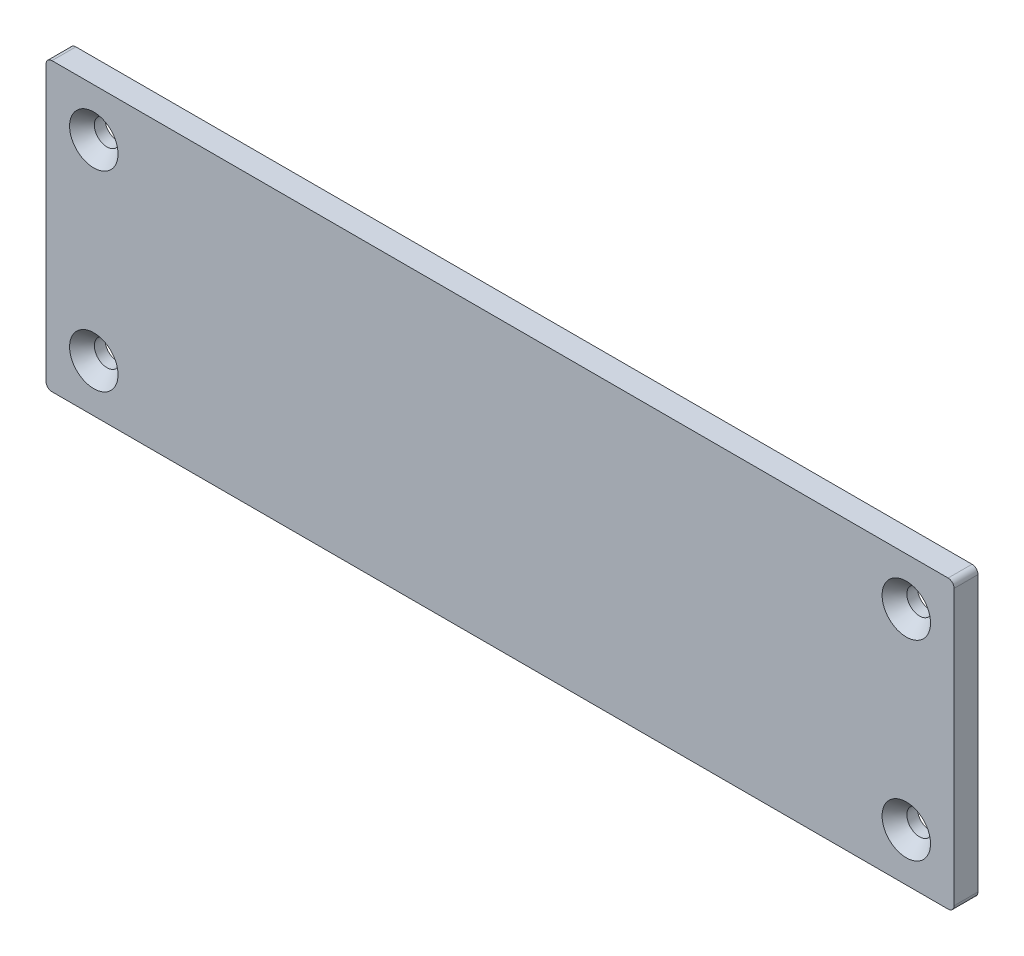
ISO-10303-21;
HEADER;
FILE_DESCRIPTION(('STEP AP214'),'2;1');
FILE_NAME('part.step','',(''),(''),'','','');
FILE_SCHEMA(('AUTOMOTIVE_DESIGN { 1 0 10303 214 1 1 1 1 }'));
ENDSEC;
DATA;
#1=APPLICATION_CONTEXT('core data for automotive mechanical design processes');
#2=APPLICATION_PROTOCOL_DEFINITION('international standard','automotive_design',2000,#1);
#3=PRODUCT_CONTEXT('',#1,'mechanical');
#4=PRODUCT('Part','Part','',(#3));
#5=PRODUCT_RELATED_PRODUCT_CATEGORY('part','',(#4));
#6=PRODUCT_DEFINITION_FORMATION('','',#4);
#7=PRODUCT_DEFINITION_CONTEXT('part definition',#1,'design');
#8=PRODUCT_DEFINITION('design','',#6,#7);
#9=PRODUCT_DEFINITION_SHAPE('','',#8);
#10=(LENGTH_UNIT() NAMED_UNIT(*) SI_UNIT(.MILLI.,.METRE.));
#11=(NAMED_UNIT(*) PLANE_ANGLE_UNIT() SI_UNIT($,.RADIAN.));
#12=(NAMED_UNIT(*) SI_UNIT($,.STERADIAN.) SOLID_ANGLE_UNIT());
#13=UNCERTAINTY_MEASURE_WITH_UNIT(LENGTH_MEASURE(1.E-05),#10,'distance_accuracy_value','');
#14=(GEOMETRIC_REPRESENTATION_CONTEXT(3) GLOBAL_UNCERTAINTY_ASSIGNED_CONTEXT((#13)) GLOBAL_UNIT_ASSIGNED_CONTEXT((#10,
#11,#12)) REPRESENTATION_CONTEXT('',''));
#15=CARTESIAN_POINT('',(0.,0.,0.));
#16=DIRECTION('',(0.,0.,1.));
#17=DIRECTION('',(1.,0.,0.));
#18=AXIS2_PLACEMENT_3D('',#15,#16,#17);
#19=CARTESIAN_POINT('',(120.65,38.1,6.35));
#20=DIRECTION('',(-1.,0.,0.));
#21=DIRECTION('',(0.,0.,1.));
#22=AXIS2_PLACEMENT_3D('',#19,#20,#21);
#23=PLANE('',#22);
#24=DIRECTION('',(0.,1.,0.));
#25=VECTOR('',#24,1.);
#26=CARTESIAN_POINT('',(120.65,38.1,0.));
#27=LINE('',#26,#25);
#28=CARTESIAN_POINT('',(120.65,-36.5125,0.));
#29=VERTEX_POINT('',#28);
#30=CARTESIAN_POINT('',(120.65,36.5125,0.));
#31=VERTEX_POINT('',#30);
#32=EDGE_CURVE('E128',#29,#31,#27,.T.);
#33=ORIENTED_EDGE('',*,*,#32,.T.);
#34=DIRECTION('',(0.,0.,-1.));
#35=VECTOR('',#34,1.);
#36=CARTESIAN_POINT('',(120.65,36.5125,6.35));
#37=LINE('',#36,#35);
#38=CARTESIAN_POINT('',(120.65,36.5125,6.35));
#39=VERTEX_POINT('',#38);
#40=EDGE_CURVE('E105',#31,#39,#37,.F.);
#41=ORIENTED_EDGE('',*,*,#40,.T.);
#42=DIRECTION('',(0.,1.,0.));
#43=VECTOR('',#42,1.);
#44=CARTESIAN_POINT('',(120.65,38.1,6.35));
#45=LINE('',#44,#43);
#46=CARTESIAN_POINT('',(120.65,-36.5125,6.35));
#47=VERTEX_POINT('',#46);
#48=EDGE_CURVE('E138',#47,#39,#45,.T.);
#49=ORIENTED_EDGE('',*,*,#48,.F.);
#50=DIRECTION('',(0.,0.,-1.));
#51=VECTOR('',#50,1.);
#52=CARTESIAN_POINT('',(120.65,-36.5125,6.35));
#53=LINE('',#52,#51);
#54=EDGE_CURVE('E110',#47,#29,#53,.T.);
#55=ORIENTED_EDGE('',*,*,#54,.T.);
#56=EDGE_LOOP('',(#33,#41,#49,#55));
#57=FACE_BOUND('',#56,.T.);
#58=ADVANCED_FACE('F33',(#57),#23,.F.);
#59=CARTESIAN_POINT('',(-120.65,38.1,6.35));
#60=DIRECTION('',(0.,-1.,0.));
#61=DIRECTION('',(0.,0.,-1.));
#62=AXIS2_PLACEMENT_3D('',#59,#60,#61);
#63=PLANE('',#62);
#64=DIRECTION('',(-1.,0.,0.));
#65=VECTOR('',#64,1.);
#66=CARTESIAN_POINT('',(-120.65,38.1,6.35));
#67=LINE('',#66,#65);
#68=CARTESIAN_POINT('',(119.0625,38.1,6.35));
#69=VERTEX_POINT('',#68);
#70=CARTESIAN_POINT('',(-119.0625,38.1,6.35));
#71=VERTEX_POINT('',#70);
#72=EDGE_CURVE('E120',#69,#71,#67,.T.);
#73=ORIENTED_EDGE('',*,*,#72,.F.);
#74=DIRECTION('',(0.,0.,-1.));
#75=VECTOR('',#74,1.);
#76=CARTESIAN_POINT('',(119.0625,38.1,6.35));
#77=LINE('',#76,#75);
#78=CARTESIAN_POINT('',(119.0625,38.1,0.));
#79=VERTEX_POINT('',#78);
#80=EDGE_CURVE('E104',#69,#79,#77,.T.);
#81=ORIENTED_EDGE('',*,*,#80,.T.);
#82=DIRECTION('',(-1.,0.,0.));
#83=VECTOR('',#82,1.);
#84=CARTESIAN_POINT('',(-120.65,38.1,0.));
#85=LINE('',#84,#83);
#86=CARTESIAN_POINT('',(-119.0625,38.1,0.));
#87=VERTEX_POINT('',#86);
#88=EDGE_CURVE('E117',#79,#87,#85,.T.);
#89=ORIENTED_EDGE('',*,*,#88,.T.);
#90=DIRECTION('',(0.,0.,-1.));
#91=VECTOR('',#90,1.);
#92=CARTESIAN_POINT('',(-119.0625,38.1,6.35));
#93=LINE('',#92,#91);
#94=EDGE_CURVE('E122',#87,#71,#93,.F.);
#95=ORIENTED_EDGE('',*,*,#94,.T.);
#96=EDGE_LOOP('',(#73,#81,#89,#95));
#97=FACE_BOUND('',#96,.T.);
#98=ADVANCED_FACE('F116',(#97),#63,.F.);
#99=CARTESIAN_POINT('',(-120.65,38.1,6.35));
#100=DIRECTION('',(1.,0.,0.));
#101=DIRECTION('',(0.,1.,0.));
#102=AXIS2_PLACEMENT_3D('',#99,#100,#101);
#103=PLANE('',#102);
#104=DIRECTION('',(0.,-1.,0.));
#105=VECTOR('',#104,1.);
#106=CARTESIAN_POINT('',(-120.65,38.1,6.35));
#107=LINE('',#106,#105);
#108=CARTESIAN_POINT('',(-120.65,36.5125,6.35));
#109=VERTEX_POINT('',#108);
#110=CARTESIAN_POINT('',(-120.65,-36.5125,6.35));
#111=VERTEX_POINT('',#110);
#112=EDGE_CURVE('E161',#109,#111,#107,.T.);
#113=ORIENTED_EDGE('',*,*,#112,.F.);
#114=DIRECTION('',(0.,0.,-1.));
#115=VECTOR('',#114,1.);
#116=CARTESIAN_POINT('',(-120.65,36.5125,6.35));
#117=LINE('',#116,#115);
#118=CARTESIAN_POINT('',(-120.65,36.5125,0.));
#119=VERTEX_POINT('',#118);
#120=EDGE_CURVE('E11',#109,#119,#117,.T.);
#121=ORIENTED_EDGE('',*,*,#120,.T.);
#122=DIRECTION('',(0.,-1.,0.));
#123=VECTOR('',#122,1.);
#124=CARTESIAN_POINT('',(-120.65,38.1,0.));
#125=LINE('',#124,#123);
#126=CARTESIAN_POINT('',(-120.65,-36.5125,0.));
#127=VERTEX_POINT('',#126);
#128=EDGE_CURVE('E127',#119,#127,#125,.T.);
#129=ORIENTED_EDGE('',*,*,#128,.T.);
#130=DIRECTION('',(0.,0.,-1.));
#131=VECTOR('',#130,1.);
#132=CARTESIAN_POINT('',(-120.65,-36.5125,6.35));
#133=LINE('',#132,#131);
#134=EDGE_CURVE('E41',#127,#111,#133,.F.);
#135=ORIENTED_EDGE('',*,*,#134,.T.);
#136=EDGE_LOOP('',(#113,#121,#129,#135));
#137=FACE_BOUND('',#136,.T.);
#138=ADVANCED_FACE('F160',(#137),#103,.F.);
#139=CARTESIAN_POINT('',(-120.65,-38.1,6.35));
#140=DIRECTION('',(0.,1.,0.));
#141=DIRECTION('',(0.,0.,1.));
#142=AXIS2_PLACEMENT_3D('',#139,#140,#141);
#143=PLANE('',#142);
#144=DIRECTION('',(1.,0.,0.));
#145=VECTOR('',#144,1.);
#146=CARTESIAN_POINT('',(-120.65,-38.1,0.));
#147=LINE('',#146,#145);
#148=CARTESIAN_POINT('',(-119.0625,-38.1,0.));
#149=VERTEX_POINT('',#148);
#150=CARTESIAN_POINT('',(119.0625,-38.1,0.));
#151=VERTEX_POINT('',#150);
#152=EDGE_CURVE('E131',#149,#151,#147,.T.);
#153=ORIENTED_EDGE('',*,*,#152,.T.);
#154=DIRECTION('',(0.,0.,-1.));
#155=VECTOR('',#154,1.);
#156=CARTESIAN_POINT('',(119.0625,-38.1,6.35));
#157=LINE('',#156,#155);
#158=CARTESIAN_POINT('',(119.0625,-38.1,6.35));
#159=VERTEX_POINT('',#158);
#160=EDGE_CURVE('E48',#151,#159,#157,.F.);
#161=ORIENTED_EDGE('',*,*,#160,.T.);
#162=DIRECTION('',(1.,0.,0.));
#163=VECTOR('',#162,1.);
#164=CARTESIAN_POINT('',(-120.65,-38.1,6.35));
#165=LINE('',#164,#163);
#166=CARTESIAN_POINT('',(-119.0625,-38.1,6.35));
#167=VERTEX_POINT('',#166);
#168=EDGE_CURVE('E139',#167,#159,#165,.T.);
#169=ORIENTED_EDGE('',*,*,#168,.F.);
#170=DIRECTION('',(0.,0.,-1.));
#171=VECTOR('',#170,1.);
#172=CARTESIAN_POINT('',(-119.0625,-38.1,6.35));
#173=LINE('',#172,#171);
#174=EDGE_CURVE('E154',#167,#149,#173,.T.);
#175=ORIENTED_EDGE('',*,*,#174,.T.);
#176=EDGE_LOOP('',(#153,#161,#169,#175));
#177=FACE_BOUND('',#176,.T.);
#178=ADVANCED_FACE('F170',(#177),#143,.F.);
#179=CARTESIAN_POINT('',(0.,0.,6.35));
#180=DIRECTION('',(0.,0.,1.));
#181=DIRECTION('',(1.,0.,0.));
#182=AXIS2_PLACEMENT_3D('',#179,#180,#181);
#183=PLANE('',#182);
#184=CARTESIAN_POINT('',(107.95,25.4,6.35));
#185=DIRECTION('',(0.,0.,1.));
#186=DIRECTION('',(1.,0.,0.));
#187=AXIS2_PLACEMENT_3D('',#184,#185,#186);
#188=CIRCLE('',#187,6.4389);
#189=CARTESIAN_POINT('',(114.3889,25.4,6.35));
#190=VERTEX_POINT('',#189);
#191=EDGE_CURVE('E212',#190,#190,#188,.T.);
#192=ORIENTED_EDGE('',*,*,#191,.F.);
#193=EDGE_LOOP('',(#192));
#194=FACE_BOUND('',#193,.T.);
#195=CARTESIAN_POINT('',(107.95,-25.4,6.35));
#196=DIRECTION('',(0.,0.,1.));
#197=DIRECTION('',(1.,0.,0.));
#198=AXIS2_PLACEMENT_3D('',#195,#196,#197);
#199=CIRCLE('',#198,6.4389);
#200=CARTESIAN_POINT('',(114.3889,-25.4,6.35));
#201=VERTEX_POINT('',#200);
#202=EDGE_CURVE('E203',#201,#201,#199,.T.);
#203=ORIENTED_EDGE('',*,*,#202,.F.);
#204=EDGE_LOOP('',(#203));
#205=FACE_BOUND('',#204,.T.);
#206=CARTESIAN_POINT('',(-107.95,25.4,6.35));
#207=DIRECTION('',(0.,0.,1.));
#208=DIRECTION('',(1.,0.,0.));
#209=AXIS2_PLACEMENT_3D('',#206,#207,#208);
#210=CIRCLE('',#209,6.4389);
#211=CARTESIAN_POINT('',(-101.5111,25.4,6.35));
#212=VERTEX_POINT('',#211);
#213=EDGE_CURVE('E194',#212,#212,#210,.T.);
#214=ORIENTED_EDGE('',*,*,#213,.F.);
#215=EDGE_LOOP('',(#214));
#216=FACE_BOUND('',#215,.T.);
#217=CARTESIAN_POINT('',(-107.95,-25.4,6.35));
#218=DIRECTION('',(0.,0.,1.));
#219=DIRECTION('',(1.,0.,0.));
#220=AXIS2_PLACEMENT_3D('',#217,#218,#219);
#221=CIRCLE('',#220,6.4389);
#222=CARTESIAN_POINT('',(-101.5111,-25.4,6.35));
#223=VERTEX_POINT('',#222);
#224=EDGE_CURVE('E185',#223,#223,#221,.T.);
#225=ORIENTED_EDGE('',*,*,#224,.F.);
#226=EDGE_LOOP('',(#225));
#227=FACE_BOUND('',#226,.T.);
#228=ORIENTED_EDGE('',*,*,#48,.T.);
#229=CARTESIAN_POINT('',(119.0625,36.5125,6.35));
#230=DIRECTION('',(0.,0.,1.));
#231=DIRECTION('',(1.,0.,0.));
#232=AXIS2_PLACEMENT_3D('',#229,#230,#231);
#233=CIRCLE('',#232,1.5875);
#234=EDGE_CURVE('E152',#39,#69,#233,.T.);
#235=ORIENTED_EDGE('',*,*,#234,.T.);
#236=ORIENTED_EDGE('',*,*,#72,.T.);
#237=CARTESIAN_POINT('',(-119.0625,36.5125,6.35));
#238=DIRECTION('',(0.,0.,1.));
#239=DIRECTION('',(1.,0.,0.));
#240=AXIS2_PLACEMENT_3D('',#237,#238,#239);
#241=CIRCLE('',#240,1.5875);
#242=EDGE_CURVE('E148',#71,#109,#241,.T.);
#243=ORIENTED_EDGE('',*,*,#242,.T.);
#244=ORIENTED_EDGE('',*,*,#112,.T.);
#245=CARTESIAN_POINT('',(-119.0625,-36.5125,6.35));
#246=DIRECTION('',(0.,0.,1.));
#247=DIRECTION('',(1.,0.,0.));
#248=AXIS2_PLACEMENT_3D('',#245,#246,#247);
#249=CIRCLE('',#248,1.5875);
#250=EDGE_CURVE('E55',#111,#167,#249,.T.);
#251=ORIENTED_EDGE('',*,*,#250,.T.);
#252=ORIENTED_EDGE('',*,*,#168,.T.);
#253=CARTESIAN_POINT('',(119.0625,-36.5125,6.35));
#254=DIRECTION('',(0.,0.,1.));
#255=DIRECTION('',(1.,0.,0.));
#256=AXIS2_PLACEMENT_3D('',#253,#254,#255);
#257=CIRCLE('',#256,1.5875);
#258=EDGE_CURVE('E150',#159,#47,#257,.T.);
#259=ORIENTED_EDGE('',*,*,#258,.T.);
#260=EDGE_LOOP('',(#228,#235,#236,#243,#244,#251,#252,#259));
#261=FACE_BOUND('',#260,.T.);
#262=ADVANCED_FACE('F165',(#194,#205,#216,#227,#261),#183,.T.);
#263=CARTESIAN_POINT('',(0.,0.,0.));
#264=DIRECTION('',(0.,0.,1.));
#265=DIRECTION('',(1.,0.,0.));
#266=AXIS2_PLACEMENT_3D('',#263,#264,#265);
#267=PLANE('',#266);
#268=CARTESIAN_POINT('',(107.95,25.4,0.));
#269=DIRECTION('',(0.,0.,1.));
#270=DIRECTION('',(1.,0.,0.));
#271=AXIS2_PLACEMENT_3D('',#268,#269,#270);
#272=CIRCLE('',#271,3.3782);
#273=CARTESIAN_POINT('',(111.3282,25.4,0.));
#274=VERTEX_POINT('',#273);
#275=EDGE_CURVE('E206',#274,#274,#272,.T.);
#276=ORIENTED_EDGE('',*,*,#275,.T.);
#277=EDGE_LOOP('',(#276));
#278=FACE_BOUND('',#277,.T.);
#279=CARTESIAN_POINT('',(107.95,-25.4,0.));
#280=DIRECTION('',(0.,0.,1.));
#281=DIRECTION('',(1.,0.,0.));
#282=AXIS2_PLACEMENT_3D('',#279,#280,#281);
#283=CIRCLE('',#282,3.3782);
#284=CARTESIAN_POINT('',(111.3282,-25.4,0.));
#285=VERTEX_POINT('',#284);
#286=EDGE_CURVE('E197',#285,#285,#283,.T.);
#287=ORIENTED_EDGE('',*,*,#286,.T.);
#288=EDGE_LOOP('',(#287));
#289=FACE_BOUND('',#288,.T.);
#290=CARTESIAN_POINT('',(-107.95,25.4,0.));
#291=DIRECTION('',(0.,0.,1.));
#292=DIRECTION('',(1.,0.,0.));
#293=AXIS2_PLACEMENT_3D('',#290,#291,#292);
#294=CIRCLE('',#293,3.3782);
#295=CARTESIAN_POINT('',(-104.5718,25.4,0.));
#296=VERTEX_POINT('',#295);
#297=EDGE_CURVE('E188',#296,#296,#294,.T.);
#298=ORIENTED_EDGE('',*,*,#297,.T.);
#299=EDGE_LOOP('',(#298));
#300=FACE_BOUND('',#299,.T.);
#301=CARTESIAN_POINT('',(-107.95,-25.4,0.));
#302=DIRECTION('',(0.,0.,1.));
#303=DIRECTION('',(1.,0.,0.));
#304=AXIS2_PLACEMENT_3D('',#301,#302,#303);
#305=CIRCLE('',#304,3.3782);
#306=CARTESIAN_POINT('',(-104.5718,-25.4,0.));
#307=VERTEX_POINT('',#306);
#308=EDGE_CURVE('E133',#307,#307,#305,.T.);
#309=ORIENTED_EDGE('',*,*,#308,.T.);
#310=EDGE_LOOP('',(#309));
#311=FACE_BOUND('',#310,.T.);
#312=ORIENTED_EDGE('',*,*,#88,.F.);
#313=CARTESIAN_POINT('',(119.0625,36.5125,0.));
#314=DIRECTION('',(0.,0.,1.));
#315=DIRECTION('',(1.,0.,0.));
#316=AXIS2_PLACEMENT_3D('',#313,#314,#315);
#317=CIRCLE('',#316,1.5875);
#318=EDGE_CURVE('E100',#79,#31,#317,.F.);
#319=ORIENTED_EDGE('',*,*,#318,.T.);
#320=ORIENTED_EDGE('',*,*,#32,.F.);
#321=CARTESIAN_POINT('',(119.0625,-36.5125,0.));
#322=DIRECTION('',(0.,0.,1.));
#323=DIRECTION('',(1.,0.,0.));
#324=AXIS2_PLACEMENT_3D('',#321,#322,#323);
#325=CIRCLE('',#324,1.5875);
#326=EDGE_CURVE('E111',#29,#151,#325,.F.);
#327=ORIENTED_EDGE('',*,*,#326,.T.);
#328=ORIENTED_EDGE('',*,*,#152,.F.);
#329=CARTESIAN_POINT('',(-119.0625,-36.5125,0.));
#330=DIRECTION('',(0.,0.,1.));
#331=DIRECTION('',(1.,0.,0.));
#332=AXIS2_PLACEMENT_3D('',#329,#330,#331);
#333=CIRCLE('',#332,1.5875);
#334=EDGE_CURVE('E121',#149,#127,#333,.F.);
#335=ORIENTED_EDGE('',*,*,#334,.T.);
#336=ORIENTED_EDGE('',*,*,#128,.F.);
#337=CARTESIAN_POINT('',(-119.0625,36.5125,0.));
#338=DIRECTION('',(0.,0.,1.));
#339=DIRECTION('',(1.,0.,0.));
#340=AXIS2_PLACEMENT_3D('',#337,#338,#339);
#341=CIRCLE('',#340,1.5875);
#342=EDGE_CURVE('E126',#119,#87,#341,.F.);
#343=ORIENTED_EDGE('',*,*,#342,.T.);
#344=EDGE_LOOP('',(#312,#319,#320,#327,#328,#335,#336,#343));
#345=FACE_BOUND('',#344,.T.);
#346=ADVANCED_FACE('F124',(#278,#289,#300,#311,#345),#267,.F.);
#347=CARTESIAN_POINT('',(-107.95,-25.4,6.35));
#348=DIRECTION('',(0.,0.,1.));
#349=DIRECTION('',(1.,0.,0.));
#350=AXIS2_PLACEMENT_3D('',#347,#348,#349);
#351=CYLINDRICAL_SURFACE('',#350,3.3782);
#352=ORIENTED_EDGE('',*,*,#308,.F.);
#353=EDGE_LOOP('',(#352));
#354=FACE_BOUND('',#353,.T.);
#355=CARTESIAN_POINT('',(-107.95,-25.4,2.82906741601866));
#356=DIRECTION('',(0.,0.,1.));
#357=DIRECTION('',(1.,0.,0.));
#358=AXIS2_PLACEMENT_3D('',#355,#356,#357);
#359=CIRCLE('',#358,3.3782);
#360=CARTESIAN_POINT('',(-104.5718,-25.4,2.82906741601866));
#361=VERTEX_POINT('',#360);
#362=EDGE_CURVE('E182',#361,#361,#359,.T.);
#363=ORIENTED_EDGE('',*,*,#362,.T.);
#364=EDGE_LOOP('',(#363));
#365=FACE_BOUND('',#364,.T.);
#366=ADVANCED_FACE('F230',(#354,#365),#351,.F.);
#367=CARTESIAN_POINT('',(-107.95,-25.4,6.35));
#368=DIRECTION('',(0.,0.,1.));
#369=DIRECTION('',(1.,0.,0.));
#370=AXIS2_PLACEMENT_3D('',#367,#368,#369);
#371=CONICAL_SURFACE('',#370,6.4389,0.715584993317675);
#372=ORIENTED_EDGE('',*,*,#362,.F.);
#373=EDGE_LOOP('',(#372));
#374=FACE_BOUND('',#373,.T.);
#375=ORIENTED_EDGE('',*,*,#224,.T.);
#376=EDGE_LOOP('',(#375));
#377=FACE_BOUND('',#376,.T.);
#378=ADVANCED_FACE('F227',(#374,#377),#371,.F.);
#379=CARTESIAN_POINT('',(-107.95,25.4,6.35));
#380=DIRECTION('',(0.,0.,1.));
#381=DIRECTION('',(1.,0.,0.));
#382=AXIS2_PLACEMENT_3D('',#379,#380,#381);
#383=CYLINDRICAL_SURFACE('',#382,3.3782);
#384=ORIENTED_EDGE('',*,*,#297,.F.);
#385=EDGE_LOOP('',(#384));
#386=FACE_BOUND('',#385,.T.);
#387=CARTESIAN_POINT('',(-107.95,25.4,2.82906741601866));
#388=DIRECTION('',(0.,0.,1.));
#389=DIRECTION('',(1.,0.,0.));
#390=AXIS2_PLACEMENT_3D('',#387,#388,#389);
#391=CIRCLE('',#390,3.3782);
#392=CARTESIAN_POINT('',(-104.5718,25.4,2.82906741601866));
#393=VERTEX_POINT('',#392);
#394=EDGE_CURVE('E191',#393,#393,#391,.T.);
#395=ORIENTED_EDGE('',*,*,#394,.T.);
#396=EDGE_LOOP('',(#395));
#397=FACE_BOUND('',#396,.T.);
#398=ADVANCED_FACE('F229',(#386,#397),#383,.F.);
#399=CARTESIAN_POINT('',(-107.95,25.4,6.35));
#400=DIRECTION('',(0.,0.,1.));
#401=DIRECTION('',(1.,0.,0.));
#402=AXIS2_PLACEMENT_3D('',#399,#400,#401);
#403=CONICAL_SURFACE('',#402,6.4389,0.715584993317675);
#404=ORIENTED_EDGE('',*,*,#394,.F.);
#405=EDGE_LOOP('',(#404));
#406=FACE_BOUND('',#405,.T.);
#407=ORIENTED_EDGE('',*,*,#213,.T.);
#408=EDGE_LOOP('',(#407));
#409=FACE_BOUND('',#408,.T.);
#410=ADVANCED_FACE('F237',(#406,#409),#403,.F.);
#411=CARTESIAN_POINT('',(107.95,-25.4,6.35));
#412=DIRECTION('',(0.,0.,1.));
#413=DIRECTION('',(1.,0.,0.));
#414=AXIS2_PLACEMENT_3D('',#411,#412,#413);
#415=CYLINDRICAL_SURFACE('',#414,3.3782);
#416=ORIENTED_EDGE('',*,*,#286,.F.);
#417=EDGE_LOOP('',(#416));
#418=FACE_BOUND('',#417,.T.);
#419=CARTESIAN_POINT('',(107.95,-25.4,2.82906741601866));
#420=DIRECTION('',(0.,0.,1.));
#421=DIRECTION('',(1.,0.,0.));
#422=AXIS2_PLACEMENT_3D('',#419,#420,#421);
#423=CIRCLE('',#422,3.3782);
#424=CARTESIAN_POINT('',(111.3282,-25.4,2.82906741601866));
#425=VERTEX_POINT('',#424);
#426=EDGE_CURVE('E200',#425,#425,#423,.T.);
#427=ORIENTED_EDGE('',*,*,#426,.T.);
#428=EDGE_LOOP('',(#427));
#429=FACE_BOUND('',#428,.T.);
#430=ADVANCED_FACE('F348',(#418,#429),#415,.F.);
#431=CARTESIAN_POINT('',(107.95,-25.4,6.35));
#432=DIRECTION('',(0.,0.,1.));
#433=DIRECTION('',(1.,0.,0.));
#434=AXIS2_PLACEMENT_3D('',#431,#432,#433);
#435=CONICAL_SURFACE('',#434,6.4389,0.715584993317675);
#436=ORIENTED_EDGE('',*,*,#426,.F.);
#437=EDGE_LOOP('',(#436));
#438=FACE_BOUND('',#437,.T.);
#439=ORIENTED_EDGE('',*,*,#202,.T.);
#440=EDGE_LOOP('',(#439));
#441=FACE_BOUND('',#440,.T.);
#442=ADVANCED_FACE('F338',(#438,#441),#435,.F.);
#443=CARTESIAN_POINT('',(107.95,25.4,6.35));
#444=DIRECTION('',(0.,0.,1.));
#445=DIRECTION('',(1.,0.,0.));
#446=AXIS2_PLACEMENT_3D('',#443,#444,#445);
#447=CYLINDRICAL_SURFACE('',#446,3.3782);
#448=ORIENTED_EDGE('',*,*,#275,.F.);
#449=EDGE_LOOP('',(#448));
#450=FACE_BOUND('',#449,.T.);
#451=CARTESIAN_POINT('',(107.95,25.4,2.82906741601866));
#452=DIRECTION('',(0.,0.,1.));
#453=DIRECTION('',(1.,0.,0.));
#454=AXIS2_PLACEMENT_3D('',#451,#452,#453);
#455=CIRCLE('',#454,3.3782);
#456=CARTESIAN_POINT('',(111.3282,25.4,2.82906741601866));
#457=VERTEX_POINT('',#456);
#458=EDGE_CURVE('E209',#457,#457,#455,.T.);
#459=ORIENTED_EDGE('',*,*,#458,.T.);
#460=EDGE_LOOP('',(#459));
#461=FACE_BOUND('',#460,.T.);
#462=ADVANCED_FACE('F328',(#450,#461),#447,.F.);
#463=CARTESIAN_POINT('',(107.95,25.4,6.35));
#464=DIRECTION('',(0.,0.,1.));
#465=DIRECTION('',(1.,0.,0.));
#466=AXIS2_PLACEMENT_3D('',#463,#464,#465);
#467=CONICAL_SURFACE('',#466,6.4389,0.715584993317675);
#468=ORIENTED_EDGE('',*,*,#458,.F.);
#469=EDGE_LOOP('',(#468));
#470=FACE_BOUND('',#469,.T.);
#471=ORIENTED_EDGE('',*,*,#191,.T.);
#472=EDGE_LOOP('',(#471));
#473=FACE_BOUND('',#472,.T.);
#474=ADVANCED_FACE('F216',(#470,#473),#467,.F.);
#475=CARTESIAN_POINT('',(119.0625,36.5125,6.35));
#476=DIRECTION('',(0.,0.,-1.));
#477=DIRECTION('',(-1.,0.,0.));
#478=AXIS2_PLACEMENT_3D('',#475,#476,#477);
#479=CYLINDRICAL_SURFACE('',#478,1.5875);
#480=ORIENTED_EDGE('',*,*,#234,.F.);
#481=ORIENTED_EDGE('',*,*,#40,.F.);
#482=ORIENTED_EDGE('',*,*,#318,.F.);
#483=ORIENTED_EDGE('',*,*,#80,.F.);
#484=EDGE_LOOP('',(#480,#481,#482,#483));
#485=FACE_BOUND('',#484,.T.);
#486=ADVANCED_FACE('F103',(#485),#479,.T.);
#487=CARTESIAN_POINT('',(119.0625,-36.5125,6.35));
#488=DIRECTION('',(0.,0.,-1.));
#489=DIRECTION('',(-1.,0.,0.));
#490=AXIS2_PLACEMENT_3D('',#487,#488,#489);
#491=CYLINDRICAL_SURFACE('',#490,1.5875);
#492=ORIENTED_EDGE('',*,*,#258,.F.);
#493=ORIENTED_EDGE('',*,*,#160,.F.);
#494=ORIENTED_EDGE('',*,*,#326,.F.);
#495=ORIENTED_EDGE('',*,*,#54,.F.);
#496=EDGE_LOOP('',(#492,#493,#494,#495));
#497=FACE_BOUND('',#496,.T.);
#498=ADVANCED_FACE('F174',(#497),#491,.T.);
#499=CARTESIAN_POINT('',(-119.0625,36.5125,6.35));
#500=DIRECTION('',(0.,0.,-1.));
#501=DIRECTION('',(-1.,0.,0.));
#502=AXIS2_PLACEMENT_3D('',#499,#500,#501);
#503=CYLINDRICAL_SURFACE('',#502,1.5875);
#504=ORIENTED_EDGE('',*,*,#242,.F.);
#505=ORIENTED_EDGE('',*,*,#94,.F.);
#506=ORIENTED_EDGE('',*,*,#342,.F.);
#507=ORIENTED_EDGE('',*,*,#120,.F.);
#508=EDGE_LOOP('',(#504,#505,#506,#507));
#509=FACE_BOUND('',#508,.T.);
#510=ADVANCED_FACE('F254',(#509),#503,.T.);
#511=CARTESIAN_POINT('',(-119.0625,-36.5125,6.35));
#512=DIRECTION('',(0.,0.,-1.));
#513=DIRECTION('',(-1.,0.,0.));
#514=AXIS2_PLACEMENT_3D('',#511,#512,#513);
#515=CYLINDRICAL_SURFACE('',#514,1.5875);
#516=ORIENTED_EDGE('',*,*,#250,.F.);
#517=ORIENTED_EDGE('',*,*,#134,.F.);
#518=ORIENTED_EDGE('',*,*,#334,.F.);
#519=ORIENTED_EDGE('',*,*,#174,.F.);
#520=EDGE_LOOP('',(#516,#517,#518,#519));
#521=FACE_BOUND('',#520,.T.);
#522=ADVANCED_FACE('F35',(#521),#515,.T.);
#523=CLOSED_SHELL('',(#58,#98,#138,#178,#262,#346,#366,#378,#398,#410,#430,#442,#462,#474,#486,
#498,#510,#522));
#524=MANIFOLD_SOLID_BREP('B2',#523);
#525=ADVANCED_BREP_SHAPE_REPRESENTATION('',(#18,#524),#14);
#526=SHAPE_DEFINITION_REPRESENTATION(#9,#525);
ENDSEC;
END-ISO-10303-21;
